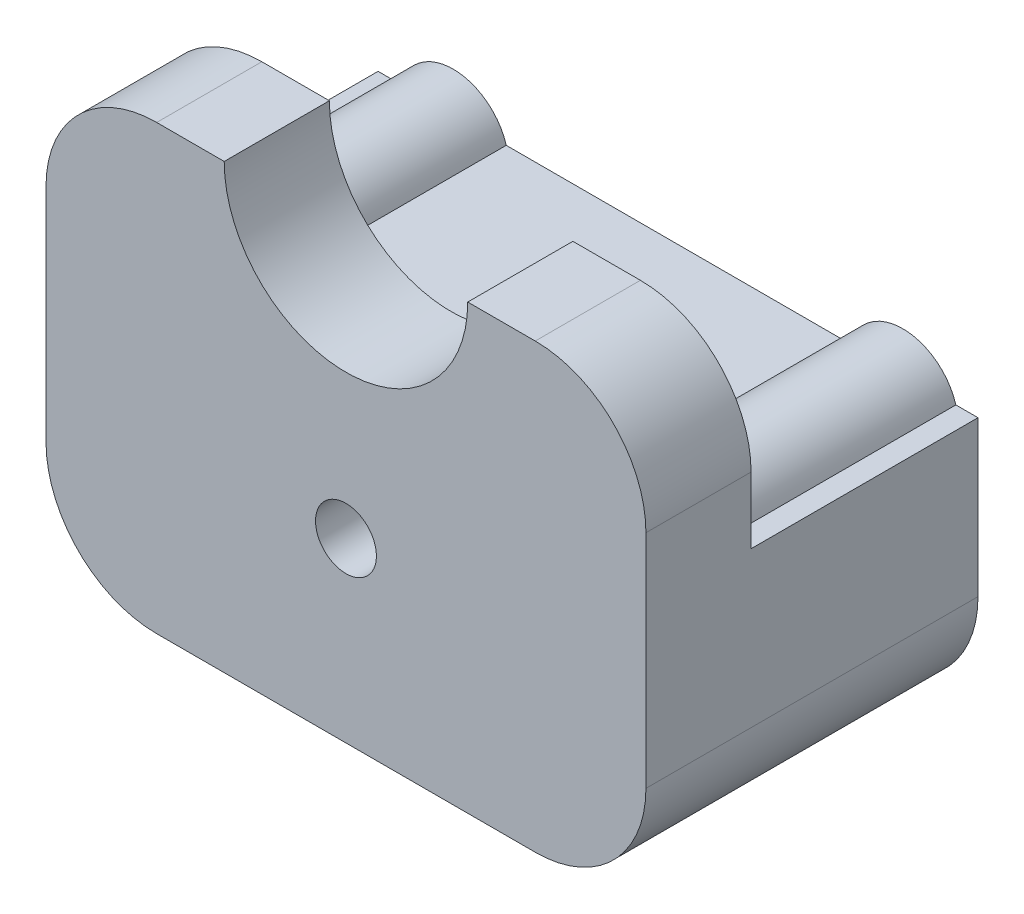
ISO-10303-21;
HEADER;
FILE_DESCRIPTION(('STEP AP214'),'2;1');
FILE_NAME('part.step','',(''),(''),'','','');
FILE_SCHEMA(('AUTOMOTIVE_DESIGN { 1 0 10303 214 1 1 1 1 }'));
ENDSEC;
DATA;
#1=APPLICATION_CONTEXT('core data for automotive mechanical design processes');
#2=APPLICATION_PROTOCOL_DEFINITION('international standard','automotive_design',2000,#1);
#3=PRODUCT_CONTEXT('',#1,'mechanical');
#4=PRODUCT('Part','Part','',(#3));
#5=PRODUCT_RELATED_PRODUCT_CATEGORY('part','',(#4));
#6=PRODUCT_DEFINITION_FORMATION('','',#4);
#7=PRODUCT_DEFINITION_CONTEXT('part definition',#1,'design');
#8=PRODUCT_DEFINITION('design','',#6,#7);
#9=PRODUCT_DEFINITION_SHAPE('','',#8);
#10=(LENGTH_UNIT() NAMED_UNIT(*) SI_UNIT(.MILLI.,.METRE.));
#11=(NAMED_UNIT(*) PLANE_ANGLE_UNIT() SI_UNIT($,.RADIAN.));
#12=(NAMED_UNIT(*) SI_UNIT($,.STERADIAN.) SOLID_ANGLE_UNIT());
#13=UNCERTAINTY_MEASURE_WITH_UNIT(LENGTH_MEASURE(1.E-05),#10,'distance_accuracy_value','');
#14=(GEOMETRIC_REPRESENTATION_CONTEXT(3) GLOBAL_UNCERTAINTY_ASSIGNED_CONTEXT((#13)) GLOBAL_UNIT_ASSIGNED_CONTEXT((#10,
#11,#12)) REPRESENTATION_CONTEXT('',''));
#15=CARTESIAN_POINT('',(0.,0.,0.));
#16=DIRECTION('',(0.,0.,1.));
#17=DIRECTION('',(1.,0.,0.));
#18=AXIS2_PLACEMENT_3D('',#15,#16,#17);
#19=CARTESIAN_POINT('',(0.,40.,25.));
#20=DIRECTION('',(0.,1.,0.));
#21=DIRECTION('',(-1.,0.,0.));
#22=AXIS2_PLACEMENT_3D('',#19,#20,#21);
#23=PLANE('',#22);
#24=DIRECTION('',(0.,0.,-1.));
#25=VECTOR('',#24,1.);
#26=CARTESIAN_POINT('',(-10.,40.,25.));
#27=LINE('',#26,#25);
#28=CARTESIAN_POINT('',(-10.,40.,30.));
#29=VERTEX_POINT('',#28);
#30=CARTESIAN_POINT('',(-10.,40.,20.5));
#31=VERTEX_POINT('',#30);
#32=EDGE_CURVE('E376',#29,#31,#27,.T.);
#33=ORIENTED_EDGE('',*,*,#32,.T.);
#34=DIRECTION('',(1.,0.,0.));
#35=VECTOR('',#34,1.);
#36=CARTESIAN_POINT('',(0.,40.,20.5));
#37=LINE('',#36,#35);
#38=CARTESIAN_POINT('',(-16.1,40.,20.5));
#39=VERTEX_POINT('',#38);
#40=EDGE_CURVE('E235',#39,#31,#37,.T.);
#41=ORIENTED_EDGE('',*,*,#40,.F.);
#42=DIRECTION('',(0.,0.,-1.));
#43=VECTOR('',#42,1.);
#44=CARTESIAN_POINT('',(-16.1,40.,25.));
#45=LINE('',#44,#43);
#46=CARTESIAN_POINT('',(-16.1,40.,30.));
#47=VERTEX_POINT('',#46);
#48=EDGE_CURVE('E339',#47,#39,#45,.T.);
#49=ORIENTED_EDGE('',*,*,#48,.F.);
#50=DIRECTION('',(-1.,0.,0.));
#51=VECTOR('',#50,1.);
#52=CARTESIAN_POINT('',(0.,40.,30.));
#53=LINE('',#52,#51);
#54=EDGE_CURVE('E274',#29,#47,#53,.T.);
#55=ORIENTED_EDGE('',*,*,#54,.F.);
#56=EDGE_LOOP('',(#33,#41,#49,#55));
#57=FACE_BOUND('',#56,.T.);
#58=ADVANCED_FACE('F35',(#57),#23,.T.);
#59=CARTESIAN_POINT('',(-27.1,40.,25.));
#60=DIRECTION('',(0.,0.,-1.));
#61=DIRECTION('',(-1.,0.,0.));
#62=AXIS2_PLACEMENT_3D('',#59,#60,#61);
#63=CYLINDRICAL_SURFACE('',#62,11.);
#64=ORIENTED_EDGE('',*,*,#48,.T.);
#65=CARTESIAN_POINT('',(-27.1,40.,20.5));
#66=DIRECTION('',(0.,0.,-1.));
#67=DIRECTION('',(-1.,0.,0.));
#68=AXIS2_PLACEMENT_3D('',#65,#66,#67);
#69=CIRCLE('',#68,11.);
#70=CARTESIAN_POINT('',(-38.1,40.,20.5));
#71=VERTEX_POINT('',#70);
#72=EDGE_CURVE('E233',#71,#39,#69,.F.);
#73=ORIENTED_EDGE('',*,*,#72,.F.);
#74=DIRECTION('',(0.,0.,-1.));
#75=VECTOR('',#74,1.);
#76=CARTESIAN_POINT('',(-38.1,40.,25.));
#77=LINE('',#76,#75);
#78=CARTESIAN_POINT('',(-38.1,40.,30.));
#79=VERTEX_POINT('',#78);
#80=EDGE_CURVE('E336',#79,#71,#77,.T.);
#81=ORIENTED_EDGE('',*,*,#80,.F.);
#82=CARTESIAN_POINT('',(-27.1,40.,30.));
#83=DIRECTION('',(0.,0.,-1.));
#84=DIRECTION('',(1.,0.,0.));
#85=AXIS2_PLACEMENT_3D('',#82,#83,#84);
#86=CIRCLE('',#85,11.);
#87=EDGE_CURVE('E276',#47,#79,#86,.T.);
#88=ORIENTED_EDGE('',*,*,#87,.F.);
#89=EDGE_LOOP('',(#64,#73,#81,#88));
#90=FACE_BOUND('',#89,.T.);
#91=ADVANCED_FACE('F441',(#90),#63,.F.);
#92=CARTESIAN_POINT('',(0.,40.,25.));
#93=DIRECTION('',(0.,-1.,0.));
#94=DIRECTION('',(1.,0.,0.));
#95=AXIS2_PLACEMENT_3D('',#92,#93,#94);
#96=PLANE('',#95);
#97=DIRECTION('',(1.,0.,0.));
#98=VECTOR('',#97,1.);
#99=CARTESIAN_POINT('',(0.,40.,20.5));
#100=LINE('',#99,#98);
#101=CARTESIAN_POINT('',(-44.2,40.,20.5));
#102=VERTEX_POINT('',#101);
#103=EDGE_CURVE('E231',#102,#71,#100,.T.);
#104=ORIENTED_EDGE('',*,*,#103,.F.);
#105=DIRECTION('',(0.,0.,-1.));
#106=VECTOR('',#105,1.);
#107=CARTESIAN_POINT('',(-44.2,40.,30.));
#108=LINE('',#107,#106);
#109=CARTESIAN_POINT('',(-44.2,40.,30.));
#110=VERTEX_POINT('',#109);
#111=EDGE_CURVE('E43',#102,#110,#108,.F.);
#112=ORIENTED_EDGE('',*,*,#111,.T.);
#113=DIRECTION('',(-1.,0.,0.));
#114=VECTOR('',#113,1.);
#115=CARTESIAN_POINT('',(-54.2,40.,30.));
#116=LINE('',#115,#114);
#117=EDGE_CURVE('E264',#79,#110,#116,.T.);
#118=ORIENTED_EDGE('',*,*,#117,.F.);
#119=ORIENTED_EDGE('',*,*,#80,.T.);
#120=EDGE_LOOP('',(#104,#112,#118,#119));
#121=FACE_BOUND('',#120,.T.);
#122=ADVANCED_FACE('F390',(#121),#96,.F.);
#123=CARTESIAN_POINT('',(-54.2,0.,25.));
#124=DIRECTION('',(-1.,0.,0.));
#125=DIRECTION('',(0.,0.,1.));
#126=AXIS2_PLACEMENT_3D('',#123,#124,#125);
#127=PLANE('',#126);
#128=DIRECTION('',(0.,1.,0.));
#129=VECTOR('',#128,1.);
#130=CARTESIAN_POINT('',(-54.2,0.,20.5));
#131=LINE('',#130,#129);
#132=CARTESIAN_POINT('',(-54.2,24.,20.5));
#133=VERTEX_POINT('',#132);
#134=CARTESIAN_POINT('',(-54.2,30.,20.5));
#135=VERTEX_POINT('',#134);
#136=EDGE_CURVE('E50',#133,#135,#131,.T.);
#137=ORIENTED_EDGE('',*,*,#136,.F.);
#138=DIRECTION('',(0.,0.,-1.));
#139=VECTOR('',#138,1.);
#140=CARTESIAN_POINT('',(-54.2,24.,20.5));
#141=LINE('',#140,#139);
#142=CARTESIAN_POINT('',(-54.2,24.,0.));
#143=VERTEX_POINT('',#142);
#144=EDGE_CURVE('E258',#133,#143,#141,.T.);
#145=ORIENTED_EDGE('',*,*,#144,.T.);
#146=DIRECTION('',(0.,1.,0.));
#147=VECTOR('',#146,1.);
#148=CARTESIAN_POINT('',(-54.2,0.,0.));
#149=LINE('',#148,#147);
#150=CARTESIAN_POINT('',(-54.2,9.99999999999999,0.));
#151=VERTEX_POINT('',#150);
#152=EDGE_CURVE('E331',#151,#143,#149,.T.);
#153=ORIENTED_EDGE('',*,*,#152,.F.);
#154=DIRECTION('',(0.,0.,-1.));
#155=VECTOR('',#154,1.);
#156=CARTESIAN_POINT('',(-54.2,9.99999999999999,25.));
#157=LINE('',#156,#155);
#158=CARTESIAN_POINT('',(-54.2,9.99999999999999,30.));
#159=VERTEX_POINT('',#158);
#160=EDGE_CURVE('E373',#151,#159,#157,.F.);
#161=ORIENTED_EDGE('',*,*,#160,.T.);
#162=DIRECTION('',(0.,-1.,0.));
#163=VECTOR('',#162,1.);
#164=CARTESIAN_POINT('',(-54.2,40.,30.));
#165=LINE('',#164,#163);
#166=CARTESIAN_POINT('',(-54.2,30.,30.));
#167=VERTEX_POINT('',#166);
#168=EDGE_CURVE('E266',#167,#159,#165,.T.);
#169=ORIENTED_EDGE('',*,*,#168,.F.);
#170=DIRECTION('',(0.,0.,-1.));
#171=VECTOR('',#170,1.);
#172=CARTESIAN_POINT('',(-54.2,30.,0.));
#173=LINE('',#172,#171);
#174=EDGE_CURVE('E384',#167,#135,#173,.T.);
#175=ORIENTED_EDGE('',*,*,#174,.T.);
#176=EDGE_LOOP('',(#137,#145,#153,#161,#169,#175));
#177=FACE_BOUND('',#176,.T.);
#178=ADVANCED_FACE('F396',(#177),#127,.T.);
#179=CARTESIAN_POINT('',(0.,0.,0.));
#180=DIRECTION('',(0.,0.,1.));
#181=DIRECTION('',(1.,0.,0.));
#182=AXIS2_PLACEMENT_3D('',#179,#180,#181);
#183=PLANE('',#182);
#184=CARTESIAN_POINT('',(-27.1,16.,0.));
#185=DIRECTION('',(0.,0.,-1.));
#186=DIRECTION('',(-1.,0.,0.));
#187=AXIS2_PLACEMENT_3D('',#184,#185,#186);
#188=CIRCLE('',#187,2.75);
#189=CARTESIAN_POINT('',(-29.85,16.,0.));
#190=VERTEX_POINT('',#189);
#191=EDGE_CURVE('E226',#190,#190,#188,.T.);
#192=ORIENTED_EDGE('',*,*,#191,.F.);
#193=EDGE_LOOP('',(#192));
#194=FACE_BOUND('',#193,.T.);
#195=DIRECTION('',(-0.984807753012209,-0.173648177666928,0.));
#196=VECTOR('',#195,1.);
#197=CARTESIAN_POINT('',(-5.39382093993512,30.5898786349278,0.));
#198=LINE('',#197,#196);
#199=CARTESIAN_POINT('',(-45.5774491813895,23.5044207932009,0.));
#200=VERTEX_POINT('',#199);
#201=CARTESIAN_POINT('',(-49.5166801934383,22.8098280825332,0.));
#202=VERTEX_POINT('',#201);
#203=EDGE_CURVE('E279',#200,#202,#198,.T.);
#204=ORIENTED_EDGE('',*,*,#203,.T.);
#205=DIRECTION('',(0.173648177666927,-0.984807753012209,0.));
#206=VECTOR('',#205,1.);
#207=CARTESIAN_POINT('',(-44.1228592535032,-7.78005055239463,0.));
#208=LINE('',#207,#206);
#209=CARTESIAN_POINT('',(-46.2,3.99999999999999,0.));
#210=VERTEX_POINT('',#209);
#211=EDGE_CURVE('E326',#202,#210,#208,.T.);
#212=ORIENTED_EDGE('',*,*,#211,.T.);
#213=DIRECTION('',(1.,0.,0.));
#214=VECTOR('',#213,1.);
#215=CARTESIAN_POINT('',(0.,3.99999999999999,0.));
#216=LINE('',#215,#214);
#217=CARTESIAN_POINT('',(-8.,3.99999999999999,0.));
#218=VERTEX_POINT('',#217);
#219=EDGE_CURVE('E323',#210,#218,#216,.T.);
#220=ORIENTED_EDGE('',*,*,#219,.T.);
#221=DIRECTION('',(0.173648177666926,0.984807753012209,0.));
#222=VECTOR('',#221,1.);
#223=CARTESIAN_POINT('',(-8.44281076979497,1.48869533173082,0.));
#224=LINE('',#223,#222);
#225=CARTESIAN_POINT('',(-4.68331980656171,22.8098280825332,0.));
#226=VERTEX_POINT('',#225);
#227=EDGE_CURVE('E320',#218,#226,#224,.T.);
#228=ORIENTED_EDGE('',*,*,#227,.T.);
#229=DIRECTION('',(-0.984807753012209,0.173648177666927,0.));
#230=VECTOR('',#229,1.);
#231=CARTESIAN_POINT('',(3.75949096323328,21.3211327508023,0.));
#232=LINE('',#231,#230);
#233=CARTESIAN_POINT('',(-8.62255081861054,23.5044207932009,0.));
#234=VERTEX_POINT('',#233);
#235=EDGE_CURVE('E317',#226,#234,#232,.T.);
#236=ORIENTED_EDGE('',*,*,#235,.T.);
#237=DIRECTION('',(-0.173648177666926,-0.984807753012209,0.));
#238=VECTOR('',#237,1.);
#239=CARTESIAN_POINT('',(-12.3820417818438,2.18328804239852,0.));
#240=LINE('',#239,#238);
#241=CARTESIAN_POINT('',(-11.3563985247091,7.99999999999999,0.));
#242=VERTEX_POINT('',#241);
#243=EDGE_CURVE('E314',#234,#242,#240,.T.);
#244=ORIENTED_EDGE('',*,*,#243,.T.);
#245=DIRECTION('',(-1.,0.,0.));
#246=VECTOR('',#245,1.);
#247=CARTESIAN_POINT('',(0.,7.99999999999999,0.));
#248=LINE('',#247,#246);
#249=CARTESIAN_POINT('',(-42.8436014752909,7.99999999999999,0.));
#250=VERTEX_POINT('',#249);
#251=EDGE_CURVE('E311',#242,#250,#248,.T.);
#252=ORIENTED_EDGE('',*,*,#251,.T.);
#253=DIRECTION('',(-0.173648177666927,0.984807753012209,0.));
#254=VECTOR('',#253,1.);
#255=CARTESIAN_POINT('',(-40.1836282414544,-7.08545784172692,0.));
#256=LINE('',#255,#254);
#257=EDGE_CURVE('E308',#250,#200,#256,.T.);
#258=ORIENTED_EDGE('',*,*,#257,.T.);
#259=EDGE_LOOP('',(#204,#212,#220,#228,#236,#244,#252,#258));
#260=FACE_BOUND('',#259,.T.);
#261=CARTESIAN_POINT('',(-6.79066728181474,22.5683900688561,0.));
#262=DIRECTION('',(0.,0.,-1.));
#263=DIRECTION('',(-1.,0.,0.));
#264=AXIS2_PLACEMENT_3D('',#261,#262,#263);
#265=CIRCLE('',#264,5.);
#266=CARTESIAN_POINT('',(-2.,24.,0.));
#267=VERTEX_POINT('',#266);
#268=CARTESIAN_POINT('',(-11.5813345636295,24.,0.));
#269=VERTEX_POINT('',#268);
#270=EDGE_CURVE('E220',#267,#269,#265,.F.);
#271=ORIENTED_EDGE('',*,*,#270,.F.);
#272=DIRECTION('',(-1.,0.,0.));
#273=VECTOR('',#272,1.);
#274=CARTESIAN_POINT('',(0.,24.,0.));
#275=LINE('',#274,#273);
#276=CARTESIAN_POINT('',(0.,24.,0.));
#277=VERTEX_POINT('',#276);
#278=EDGE_CURVE('E223',#277,#267,#275,.T.);
#279=ORIENTED_EDGE('',*,*,#278,.F.);
#280=DIRECTION('',(0.,-1.,0.));
#281=VECTOR('',#280,1.);
#282=CARTESIAN_POINT('',(0.,0.,0.));
#283=LINE('',#282,#281);
#284=CARTESIAN_POINT('',(0.,10.,0.));
#285=VERTEX_POINT('',#284);
#286=EDGE_CURVE('E329',#277,#285,#283,.T.);
#287=ORIENTED_EDGE('',*,*,#286,.T.);
#288=CARTESIAN_POINT('',(-10.,10.,0.));
#289=DIRECTION('',(0.,0.,1.));
#290=DIRECTION('',(1.,0.,0.));
#291=AXIS2_PLACEMENT_3D('',#288,#289,#290);
#292=CIRCLE('',#291,10.);
#293=CARTESIAN_POINT('',(-10.,0.,0.));
#294=VERTEX_POINT('',#293);
#295=EDGE_CURVE('E362',#285,#294,#292,.F.);
#296=ORIENTED_EDGE('',*,*,#295,.T.);
#297=DIRECTION('',(-1.,0.,0.));
#298=VECTOR('',#297,1.);
#299=CARTESIAN_POINT('',(0.,0.,0.));
#300=LINE('',#299,#298);
#301=CARTESIAN_POINT('',(-44.2,0.,0.));
#302=VERTEX_POINT('',#301);
#303=EDGE_CURVE('E284',#294,#302,#300,.T.);
#304=ORIENTED_EDGE('',*,*,#303,.T.);
#305=CARTESIAN_POINT('',(-44.2,9.99999999999999,0.));
#306=DIRECTION('',(0.,0.,1.));
#307=DIRECTION('',(1.,0.,0.));
#308=AXIS2_PLACEMENT_3D('',#305,#306,#307);
#309=CIRCLE('',#308,10.);
#310=EDGE_CURVE('E360',#302,#151,#309,.F.);
#311=ORIENTED_EDGE('',*,*,#310,.T.);
#312=ORIENTED_EDGE('',*,*,#152,.T.);
#313=DIRECTION('',(1.,0.,0.));
#314=VECTOR('',#313,1.);
#315=CARTESIAN_POINT('',(0.,24.,0.));
#316=LINE('',#315,#314);
#317=CARTESIAN_POINT('',(-52.2,24.,0.));
#318=VERTEX_POINT('',#317);
#319=EDGE_CURVE('E246',#143,#318,#316,.T.);
#320=ORIENTED_EDGE('',*,*,#319,.T.);
#321=CARTESIAN_POINT('',(-47.4093327181853,22.5683900688561,0.));
#322=DIRECTION('',(0.,0.,-1.));
#323=DIRECTION('',(-1.,0.,0.));
#324=AXIS2_PLACEMENT_3D('',#321,#322,#323);
#325=CIRCLE('',#324,5.);
#326=CARTESIAN_POINT('',(-42.6186654363705,24.,0.));
#327=VERTEX_POINT('',#326);
#328=EDGE_CURVE('E243',#327,#318,#325,.F.);
#329=ORIENTED_EDGE('',*,*,#328,.F.);
#330=DIRECTION('',(-1.,0.,0.));
#331=VECTOR('',#330,1.);
#332=CARTESIAN_POINT('',(0.,24.,0.));
#333=LINE('',#332,#331);
#334=EDGE_CURVE('E204',#269,#327,#333,.T.);
#335=ORIENTED_EDGE('',*,*,#334,.F.);
#336=EDGE_LOOP('',(#271,#279,#287,#296,#304,#311,#312,#320,#329,#335));
#337=FACE_BOUND('',#336,.T.);
#338=ADVANCED_FACE('F411',(#194,#260,#337),#183,.F.);
#339=CARTESIAN_POINT('',(-10.,30.,25.));
#340=DIRECTION('',(0.,0.,-1.));
#341=DIRECTION('',(-1.,0.,0.));
#342=AXIS2_PLACEMENT_3D('',#339,#340,#341);
#343=CYLINDRICAL_SURFACE('',#342,10.);
#344=DIRECTION('',(0.,0.,-1.));
#345=VECTOR('',#344,1.);
#346=CARTESIAN_POINT('',(0.,30.,25.));
#347=LINE('',#346,#345);
#348=CARTESIAN_POINT('',(0.,30.,20.5));
#349=VERTEX_POINT('',#348);
#350=CARTESIAN_POINT('',(0.,30.,30.));
#351=VERTEX_POINT('',#350);
#352=EDGE_CURVE('E379',#349,#351,#347,.F.);
#353=ORIENTED_EDGE('',*,*,#352,.F.);
#354=CARTESIAN_POINT('',(-10.,30.,20.5));
#355=DIRECTION('',(0.,0.,-1.));
#356=DIRECTION('',(-1.,0.,0.));
#357=AXIS2_PLACEMENT_3D('',#354,#355,#356);
#358=CIRCLE('',#357,10.);
#359=EDGE_CURVE('E253',#349,#31,#358,.F.);
#360=ORIENTED_EDGE('',*,*,#359,.T.);
#361=ORIENTED_EDGE('',*,*,#32,.F.);
#362=CARTESIAN_POINT('',(-10.,30.,30.));
#363=DIRECTION('',(0.,0.,1.));
#364=DIRECTION('',(1.,0.,0.));
#365=AXIS2_PLACEMENT_3D('',#362,#363,#364);
#366=CIRCLE('',#365,10.);
#367=EDGE_CURVE('E382',#351,#29,#366,.T.);
#368=ORIENTED_EDGE('',*,*,#367,.F.);
#369=EDGE_LOOP('',(#353,#360,#361,#368));
#370=FACE_BOUND('',#369,.T.);
#371=ADVANCED_FACE('F433',(#370),#343,.T.);
#372=CARTESIAN_POINT('',(-44.2,30.,25.));
#373=DIRECTION('',(0.,0.,1.));
#374=DIRECTION('',(1.,0.,0.));
#375=AXIS2_PLACEMENT_3D('',#372,#373,#374);
#376=CYLINDRICAL_SURFACE('',#375,10.);
#377=ORIENTED_EDGE('',*,*,#111,.F.);
#378=CARTESIAN_POINT('',(-44.2,30.,20.5));
#379=DIRECTION('',(0.,0.,-1.));
#380=DIRECTION('',(-1.,0.,0.));
#381=AXIS2_PLACEMENT_3D('',#378,#379,#380);
#382=CIRCLE('',#381,10.);
#383=EDGE_CURVE('E11',#102,#135,#382,.F.);
#384=ORIENTED_EDGE('',*,*,#383,.T.);
#385=ORIENTED_EDGE('',*,*,#174,.F.);
#386=CARTESIAN_POINT('',(-44.2,30.,30.));
#387=DIRECTION('',(0.,0.,1.));
#388=DIRECTION('',(1.,0.,0.));
#389=AXIS2_PLACEMENT_3D('',#386,#387,#388);
#390=CIRCLE('',#389,10.);
#391=EDGE_CURVE('E57',#110,#167,#390,.T.);
#392=ORIENTED_EDGE('',*,*,#391,.F.);
#393=EDGE_LOOP('',(#377,#384,#385,#392));
#394=FACE_BOUND('',#393,.T.);
#395=ADVANCED_FACE('F37',(#394),#376,.T.);
#396=CARTESIAN_POINT('',(0.,0.,25.));
#397=DIRECTION('',(1.,0.,0.));
#398=DIRECTION('',(0.,1.,0.));
#399=AXIS2_PLACEMENT_3D('',#396,#397,#398);
#400=PLANE('',#399);
#401=DIRECTION('',(0.,0.,-1.));
#402=VECTOR('',#401,1.);
#403=CARTESIAN_POINT('',(0.,24.,20.5));
#404=LINE('',#403,#402);
#405=CARTESIAN_POINT('',(0.,24.,20.5));
#406=VERTEX_POINT('',#405);
#407=EDGE_CURVE('E256',#406,#277,#404,.T.);
#408=ORIENTED_EDGE('',*,*,#407,.F.);
#409=DIRECTION('',(0.,-1.,0.));
#410=VECTOR('',#409,1.);
#411=CARTESIAN_POINT('',(0.,0.,20.5));
#412=LINE('',#411,#410);
#413=EDGE_CURVE('E237',#349,#406,#412,.T.);
#414=ORIENTED_EDGE('',*,*,#413,.F.);
#415=ORIENTED_EDGE('',*,*,#352,.T.);
#416=DIRECTION('',(0.,1.,0.));
#417=VECTOR('',#416,1.);
#418=CARTESIAN_POINT('',(0.,0.,30.));
#419=LINE('',#418,#417);
#420=CARTESIAN_POINT('',(0.,10.,30.));
#421=VERTEX_POINT('',#420);
#422=EDGE_CURVE('E271',#421,#351,#419,.T.);
#423=ORIENTED_EDGE('',*,*,#422,.F.);
#424=DIRECTION('',(0.,0.,-1.));
#425=VECTOR('',#424,1.);
#426=CARTESIAN_POINT('',(0.,10.,25.));
#427=LINE('',#426,#425);
#428=EDGE_CURVE('E343',#421,#285,#427,.T.);
#429=ORIENTED_EDGE('',*,*,#428,.T.);
#430=ORIENTED_EDGE('',*,*,#286,.F.);
#431=EDGE_LOOP('',(#408,#414,#415,#423,#429,#430));
#432=FACE_BOUND('',#431,.T.);
#433=ADVANCED_FACE('F424',(#432),#400,.T.);
#434=CARTESIAN_POINT('',(-5.39382093993512,30.5898786349278,25.));
#435=DIRECTION('',(0.173648177666928,-0.984807753012209,0.));
#436=DIRECTION('',(0.984807753012209,0.173648177666928,0.));
#437=AXIS2_PLACEMENT_3D('',#434,#435,#436);
#438=PLANE('',#437);
#439=ORIENTED_EDGE('',*,*,#203,.F.);
#440=DIRECTION('',(0.,0.,-1.));
#441=VECTOR('',#440,1.);
#442=CARTESIAN_POINT('',(-45.5774491813895,23.5044207932009,25.));
#443=LINE('',#442,#441);
#444=CARTESIAN_POINT('',(-45.5774491813895,23.5044207932009,25.));
#445=VERTEX_POINT('',#444);
#446=EDGE_CURVE('E340',#445,#200,#443,.T.);
#447=ORIENTED_EDGE('',*,*,#446,.F.);
#448=DIRECTION('',(-0.984807753012209,-0.173648177666928,0.));
#449=VECTOR('',#448,1.);
#450=CARTESIAN_POINT('',(-5.39382093993512,30.5898786349278,25.));
#451=LINE('',#450,#449);
#452=CARTESIAN_POINT('',(-49.5166801934383,22.8098280825332,25.));
#453=VERTEX_POINT('',#452);
#454=EDGE_CURVE('E280',#445,#453,#451,.T.);
#455=ORIENTED_EDGE('',*,*,#454,.T.);
#456=DIRECTION('',(0.,0.,-1.));
#457=VECTOR('',#456,1.);
#458=CARTESIAN_POINT('',(-49.5166801934383,22.8098280825332,25.));
#459=LINE('',#458,#457);
#460=EDGE_CURVE('E305',#453,#202,#459,.T.);
#461=ORIENTED_EDGE('',*,*,#460,.T.);
#462=EDGE_LOOP('',(#439,#447,#455,#461));
#463=FACE_BOUND('',#462,.T.);
#464=ADVANCED_FACE('F454',(#463),#438,.T.);
#465=CARTESIAN_POINT('',(-40.1836282414544,-7.08545784172692,25.));
#466=DIRECTION('',(-0.984807753012209,-0.173648177666927,0.));
#467=DIRECTION('',(0.173648177666927,-0.984807753012209,0.));
#468=AXIS2_PLACEMENT_3D('',#465,#466,#467);
#469=PLANE('',#468);
#470=ORIENTED_EDGE('',*,*,#257,.F.);
#471=DIRECTION('',(0.,0.,-1.));
#472=VECTOR('',#471,1.);
#473=CARTESIAN_POINT('',(-42.8436014752909,7.99999999999999,25.));
#474=LINE('',#473,#472);
#475=CARTESIAN_POINT('',(-42.8436014752909,7.99999999999999,25.));
#476=VERTEX_POINT('',#475);
#477=EDGE_CURVE('E355',#476,#250,#474,.T.);
#478=ORIENTED_EDGE('',*,*,#477,.F.);
#479=DIRECTION('',(-0.173648177666927,0.984807753012209,0.));
#480=VECTOR('',#479,1.);
#481=CARTESIAN_POINT('',(-40.1836282414544,-7.08545784172692,25.));
#482=LINE('',#481,#480);
#483=EDGE_CURVE('E283',#476,#445,#482,.T.);
#484=ORIENTED_EDGE('',*,*,#483,.T.);
#485=ORIENTED_EDGE('',*,*,#446,.T.);
#486=EDGE_LOOP('',(#470,#478,#484,#485));
#487=FACE_BOUND('',#486,.T.);
#488=ADVANCED_FACE('F478',(#487),#469,.T.);
#489=CARTESIAN_POINT('',(0.,7.99999999999999,25.));
#490=DIRECTION('',(0.,-1.,0.));
#491=DIRECTION('',(1.,0.,0.));
#492=AXIS2_PLACEMENT_3D('',#489,#490,#491);
#493=PLANE('',#492);
#494=ORIENTED_EDGE('',*,*,#251,.F.);
#495=DIRECTION('',(0.,0.,-1.));
#496=VECTOR('',#495,1.);
#497=CARTESIAN_POINT('',(-11.3563985247091,7.99999999999999,25.));
#498=LINE('',#497,#496);
#499=CARTESIAN_POINT('',(-11.3563985247091,7.99999999999999,25.));
#500=VERTEX_POINT('',#499);
#501=EDGE_CURVE('E353',#500,#242,#498,.T.);
#502=ORIENTED_EDGE('',*,*,#501,.F.);
#503=DIRECTION('',(-1.,0.,0.));
#504=VECTOR('',#503,1.);
#505=CARTESIAN_POINT('',(0.,7.99999999999999,25.));
#506=LINE('',#505,#504);
#507=EDGE_CURVE('E287',#500,#476,#506,.T.);
#508=ORIENTED_EDGE('',*,*,#507,.T.);
#509=ORIENTED_EDGE('',*,*,#477,.T.);
#510=EDGE_LOOP('',(#494,#502,#508,#509));
#511=FACE_BOUND('',#510,.T.);
#512=ADVANCED_FACE('F474',(#511),#493,.T.);
#513=CARTESIAN_POINT('',(-12.3820417818438,2.18328804239852,25.));
#514=DIRECTION('',(0.984807753012209,-0.173648177666926,0.));
#515=DIRECTION('',(0.173648177666926,0.984807753012209,0.));
#516=AXIS2_PLACEMENT_3D('',#513,#514,#515);
#517=PLANE('',#516);
#518=ORIENTED_EDGE('',*,*,#243,.F.);
#519=DIRECTION('',(0.,0.,-1.));
#520=VECTOR('',#519,1.);
#521=CARTESIAN_POINT('',(-8.62255081861054,23.5044207932009,25.));
#522=LINE('',#521,#520);
#523=CARTESIAN_POINT('',(-8.62255081861054,23.5044207932009,25.));
#524=VERTEX_POINT('',#523);
#525=EDGE_CURVE('E351',#524,#234,#522,.T.);
#526=ORIENTED_EDGE('',*,*,#525,.F.);
#527=DIRECTION('',(-0.173648177666926,-0.984807753012209,0.));
#528=VECTOR('',#527,1.);
#529=CARTESIAN_POINT('',(-12.3820417818438,2.18328804239852,25.));
#530=LINE('',#529,#528);
#531=EDGE_CURVE('E290',#524,#500,#530,.T.);
#532=ORIENTED_EDGE('',*,*,#531,.T.);
#533=ORIENTED_EDGE('',*,*,#501,.T.);
#534=EDGE_LOOP('',(#518,#526,#532,#533));
#535=FACE_BOUND('',#534,.T.);
#536=ADVANCED_FACE('F470',(#535),#517,.T.);
#537=CARTESIAN_POINT('',(3.75949096323328,21.3211327508023,25.));
#538=DIRECTION('',(-0.173648177666927,-0.984807753012209,0.));
#539=DIRECTION('',(0.984807753012209,-0.173648177666927,0.));
#540=AXIS2_PLACEMENT_3D('',#537,#538,#539);
#541=PLANE('',#540);
#542=ORIENTED_EDGE('',*,*,#235,.F.);
#543=DIRECTION('',(0.,0.,-1.));
#544=VECTOR('',#543,1.);
#545=CARTESIAN_POINT('',(-4.68331980656171,22.8098280825332,25.));
#546=LINE('',#545,#544);
#547=CARTESIAN_POINT('',(-4.68331980656171,22.8098280825332,25.));
#548=VERTEX_POINT('',#547);
#549=EDGE_CURVE('E349',#548,#226,#546,.T.);
#550=ORIENTED_EDGE('',*,*,#549,.F.);
#551=DIRECTION('',(-0.984807753012209,0.173648177666927,0.));
#552=VECTOR('',#551,1.);
#553=CARTESIAN_POINT('',(3.75949096323328,21.3211327508023,25.));
#554=LINE('',#553,#552);
#555=EDGE_CURVE('E293',#548,#524,#554,.T.);
#556=ORIENTED_EDGE('',*,*,#555,.T.);
#557=ORIENTED_EDGE('',*,*,#525,.T.);
#558=EDGE_LOOP('',(#542,#550,#556,#557));
#559=FACE_BOUND('',#558,.T.);
#560=ADVANCED_FACE('F466',(#559),#541,.T.);
#561=CARTESIAN_POINT('',(-8.44281076979497,1.48869533173082,25.));
#562=DIRECTION('',(-0.984807753012209,0.173648177666926,0.));
#563=DIRECTION('',(-0.173648177666926,-0.984807753012209,0.));
#564=AXIS2_PLACEMENT_3D('',#561,#562,#563);
#565=PLANE('',#564);
#566=ORIENTED_EDGE('',*,*,#227,.F.);
#567=DIRECTION('',(0.,0.,-1.));
#568=VECTOR('',#567,1.);
#569=CARTESIAN_POINT('',(-8.,3.99999999999999,25.));
#570=LINE('',#569,#568);
#571=CARTESIAN_POINT('',(-8.,3.99999999999999,25.));
#572=VERTEX_POINT('',#571);
#573=EDGE_CURVE('E347',#572,#218,#570,.T.);
#574=ORIENTED_EDGE('',*,*,#573,.F.);
#575=DIRECTION('',(0.173648177666926,0.984807753012209,0.));
#576=VECTOR('',#575,1.);
#577=CARTESIAN_POINT('',(-8.44281076979497,1.48869533173082,25.));
#578=LINE('',#577,#576);
#579=EDGE_CURVE('E296',#572,#548,#578,.T.);
#580=ORIENTED_EDGE('',*,*,#579,.T.);
#581=ORIENTED_EDGE('',*,*,#549,.T.);
#582=EDGE_LOOP('',(#566,#574,#580,#581));
#583=FACE_BOUND('',#582,.T.);
#584=ADVANCED_FACE('F462',(#583),#565,.T.);
#585=CARTESIAN_POINT('',(0.,3.99999999999999,25.));
#586=DIRECTION('',(0.,1.,0.));
#587=DIRECTION('',(-1.,0.,0.));
#588=AXIS2_PLACEMENT_3D('',#585,#586,#587);
#589=PLANE('',#588);
#590=ORIENTED_EDGE('',*,*,#219,.F.);
#591=DIRECTION('',(0.,0.,-1.));
#592=VECTOR('',#591,1.);
#593=CARTESIAN_POINT('',(-46.2,3.99999999999999,25.));
#594=LINE('',#593,#592);
#595=CARTESIAN_POINT('',(-46.2,3.99999999999999,25.));
#596=VERTEX_POINT('',#595);
#597=EDGE_CURVE('E345',#596,#210,#594,.T.);
#598=ORIENTED_EDGE('',*,*,#597,.F.);
#599=DIRECTION('',(1.,0.,0.));
#600=VECTOR('',#599,1.);
#601=CARTESIAN_POINT('',(0.,3.99999999999999,25.));
#602=LINE('',#601,#600);
#603=EDGE_CURVE('E299',#596,#572,#602,.T.);
#604=ORIENTED_EDGE('',*,*,#603,.T.);
#605=ORIENTED_EDGE('',*,*,#573,.T.);
#606=EDGE_LOOP('',(#590,#598,#604,#605));
#607=FACE_BOUND('',#606,.T.);
#608=ADVANCED_FACE('F458',(#607),#589,.T.);
#609=CARTESIAN_POINT('',(-44.1228592535032,-7.78005055239463,25.));
#610=DIRECTION('',(0.984807753012209,0.173648177666927,0.));
#611=DIRECTION('',(-0.173648177666927,0.984807753012209,0.));
#612=AXIS2_PLACEMENT_3D('',#609,#610,#611);
#613=PLANE('',#612);
#614=ORIENTED_EDGE('',*,*,#211,.F.);
#615=ORIENTED_EDGE('',*,*,#460,.F.);
#616=DIRECTION('',(0.173648177666927,-0.984807753012209,0.));
#617=VECTOR('',#616,1.);
#618=CARTESIAN_POINT('',(-44.1228592535032,-7.78005055239463,25.));
#619=LINE('',#618,#617);
#620=EDGE_CURVE('E302',#453,#596,#619,.T.);
#621=ORIENTED_EDGE('',*,*,#620,.T.);
#622=ORIENTED_EDGE('',*,*,#597,.T.);
#623=EDGE_LOOP('',(#614,#615,#621,#622));
#624=FACE_BOUND('',#623,.T.);
#625=ADVANCED_FACE('F455',(#624),#613,.T.);
#626=CARTESIAN_POINT('',(0.,0.,25.));
#627=DIRECTION('',(0.,-1.,0.));
#628=DIRECTION('',(1.,0.,0.));
#629=AXIS2_PLACEMENT_3D('',#626,#627,#628);
#630=PLANE('',#629);
#631=ORIENTED_EDGE('',*,*,#303,.F.);
#632=DIRECTION('',(0.,0.,-1.));
#633=VECTOR('',#632,1.);
#634=CARTESIAN_POINT('',(-10.,0.,25.));
#635=LINE('',#634,#633);
#636=CARTESIAN_POINT('',(-10.,0.,30.));
#637=VERTEX_POINT('',#636);
#638=EDGE_CURVE('E367',#294,#637,#635,.F.);
#639=ORIENTED_EDGE('',*,*,#638,.T.);
#640=DIRECTION('',(1.,0.,0.));
#641=VECTOR('',#640,1.);
#642=CARTESIAN_POINT('',(-54.2,0.,30.));
#643=LINE('',#642,#641);
#644=CARTESIAN_POINT('',(-44.2,0.,30.));
#645=VERTEX_POINT('',#644);
#646=EDGE_CURVE('E268',#645,#637,#643,.T.);
#647=ORIENTED_EDGE('',*,*,#646,.F.);
#648=DIRECTION('',(0.,0.,-1.));
#649=VECTOR('',#648,1.);
#650=CARTESIAN_POINT('',(-44.2,0.,25.));
#651=LINE('',#650,#649);
#652=EDGE_CURVE('E364',#645,#302,#651,.T.);
#653=ORIENTED_EDGE('',*,*,#652,.T.);
#654=EDGE_LOOP('',(#631,#639,#647,#653));
#655=FACE_BOUND('',#654,.T.);
#656=ADVANCED_FACE('F406',(#655),#630,.T.);
#657=CARTESIAN_POINT('',(-27.1,40.,30.));
#658=DIRECTION('',(0.,0.,1.));
#659=DIRECTION('',(1.,0.,0.));
#660=AXIS2_PLACEMENT_3D('',#657,#658,#659);
#661=PLANE('',#660);
#662=CARTESIAN_POINT('',(-27.1,16.,30.));
#663=DIRECTION('',(0.,0.,-1.));
#664=DIRECTION('',(-1.,0.,0.));
#665=AXIS2_PLACEMENT_3D('',#662,#663,#664);
#666=CIRCLE('',#665,2.75);
#667=CARTESIAN_POINT('',(-29.85,16.,30.));
#668=VERTEX_POINT('',#667);
#669=EDGE_CURVE('E244',#668,#668,#666,.T.);
#670=ORIENTED_EDGE('',*,*,#669,.T.);
#671=EDGE_LOOP('',(#670));
#672=FACE_BOUND('',#671,.T.);
#673=ORIENTED_EDGE('',*,*,#422,.T.);
#674=ORIENTED_EDGE('',*,*,#367,.T.);
#675=ORIENTED_EDGE('',*,*,#54,.T.);
#676=ORIENTED_EDGE('',*,*,#87,.T.);
#677=ORIENTED_EDGE('',*,*,#117,.T.);
#678=ORIENTED_EDGE('',*,*,#391,.T.);
#679=ORIENTED_EDGE('',*,*,#168,.T.);
#680=CARTESIAN_POINT('',(-44.2,9.99999999999999,30.));
#681=DIRECTION('',(0.,0.,1.));
#682=DIRECTION('',(1.,0.,0.));
#683=AXIS2_PLACEMENT_3D('',#680,#681,#682);
#684=CIRCLE('',#683,10.);
#685=EDGE_CURVE('E369',#159,#645,#684,.T.);
#686=ORIENTED_EDGE('',*,*,#685,.T.);
#687=ORIENTED_EDGE('',*,*,#646,.T.);
#688=CARTESIAN_POINT('',(-10.,10.,30.));
#689=DIRECTION('',(0.,0.,1.));
#690=DIRECTION('',(1.,0.,0.));
#691=AXIS2_PLACEMENT_3D('',#688,#689,#690);
#692=CIRCLE('',#691,10.);
#693=EDGE_CURVE('E371',#637,#421,#692,.T.);
#694=ORIENTED_EDGE('',*,*,#693,.T.);
#695=EDGE_LOOP('',(#673,#674,#675,#676,#677,#678,#679,#686,#687,#694));
#696=FACE_BOUND('',#695,.T.);
#697=ADVANCED_FACE('F392',(#672,#696),#661,.T.);
#698=CARTESIAN_POINT('',(-27.1,40.,25.));
#699=DIRECTION('',(0.,0.,1.));
#700=DIRECTION('',(1.,0.,0.));
#701=AXIS2_PLACEMENT_3D('',#698,#699,#700);
#702=PLANE('',#701);
#703=ORIENTED_EDGE('',*,*,#454,.F.);
#704=ORIENTED_EDGE('',*,*,#483,.F.);
#705=ORIENTED_EDGE('',*,*,#507,.F.);
#706=ORIENTED_EDGE('',*,*,#531,.F.);
#707=ORIENTED_EDGE('',*,*,#555,.F.);
#708=ORIENTED_EDGE('',*,*,#579,.F.);
#709=ORIENTED_EDGE('',*,*,#603,.F.);
#710=ORIENTED_EDGE('',*,*,#620,.F.);
#711=EDGE_LOOP('',(#703,#704,#705,#706,#707,#708,#709,#710));
#712=FACE_BOUND('',#711,.T.);
#713=ADVANCED_FACE('F488',(#712),#702,.F.);
#714=CARTESIAN_POINT('',(-10.,10.,25.));
#715=DIRECTION('',(0.,0.,-1.));
#716=DIRECTION('',(-1.,0.,0.));
#717=AXIS2_PLACEMENT_3D('',#714,#715,#716);
#718=CYLINDRICAL_SURFACE('',#717,10.);
#719=ORIENTED_EDGE('',*,*,#693,.F.);
#720=ORIENTED_EDGE('',*,*,#638,.F.);
#721=ORIENTED_EDGE('',*,*,#295,.F.);
#722=ORIENTED_EDGE('',*,*,#428,.F.);
#723=EDGE_LOOP('',(#719,#720,#721,#722));
#724=FACE_BOUND('',#723,.T.);
#725=ADVANCED_FACE('F430',(#724),#718,.T.);
#726=CARTESIAN_POINT('',(-44.2,9.99999999999999,25.));
#727=DIRECTION('',(0.,0.,-1.));
#728=DIRECTION('',(-1.,0.,0.));
#729=AXIS2_PLACEMENT_3D('',#726,#727,#728);
#730=CYLINDRICAL_SURFACE('',#729,10.);
#731=ORIENTED_EDGE('',*,*,#685,.F.);
#732=ORIENTED_EDGE('',*,*,#160,.F.);
#733=ORIENTED_EDGE('',*,*,#310,.F.);
#734=ORIENTED_EDGE('',*,*,#652,.F.);
#735=EDGE_LOOP('',(#731,#732,#733,#734));
#736=FACE_BOUND('',#735,.T.);
#737=ADVANCED_FACE('F408',(#736),#730,.T.);
#738=CARTESIAN_POINT('',(0.,24.,20.5));
#739=DIRECTION('',(0.,-1.,0.));
#740=DIRECTION('',(0.,0.,-1.));
#741=AXIS2_PLACEMENT_3D('',#738,#739,#740);
#742=PLANE('',#741);
#743=ORIENTED_EDGE('',*,*,#334,.T.);
#744=DIRECTION('',(0.,0.,-1.));
#745=VECTOR('',#744,1.);
#746=CARTESIAN_POINT('',(-42.6186654363705,24.,20.5));
#747=LINE('',#746,#745);
#748=CARTESIAN_POINT('',(-42.6186654363705,24.,20.5));
#749=VERTEX_POINT('',#748);
#750=EDGE_CURVE('E197',#749,#327,#747,.T.);
#751=ORIENTED_EDGE('',*,*,#750,.F.);
#752=DIRECTION('',(-1.,0.,0.));
#753=VECTOR('',#752,1.);
#754=CARTESIAN_POINT('',(0.,24.,20.5));
#755=LINE('',#754,#753);
#756=CARTESIAN_POINT('',(-11.5813345636295,24.,20.5));
#757=VERTEX_POINT('',#756);
#758=EDGE_CURVE('E201',#757,#749,#755,.T.);
#759=ORIENTED_EDGE('',*,*,#758,.F.);
#760=DIRECTION('',(0.,0.,-1.));
#761=VECTOR('',#760,1.);
#762=CARTESIAN_POINT('',(-11.5813345636295,24.,20.5));
#763=LINE('',#762,#761);
#764=EDGE_CURVE('E251',#757,#269,#763,.T.);
#765=ORIENTED_EDGE('',*,*,#764,.T.);
#766=EDGE_LOOP('',(#743,#751,#759,#765));
#767=FACE_BOUND('',#766,.T.);
#768=ADVANCED_FACE('F199',(#767),#742,.F.);
#769=CARTESIAN_POINT('',(-6.79066728181474,22.5683900688561,20.5));
#770=DIRECTION('',(0.,0.,-1.));
#771=DIRECTION('',(-1.,0.,0.));
#772=AXIS2_PLACEMENT_3D('',#769,#770,#771);
#773=CYLINDRICAL_SURFACE('',#772,5.);
#774=ORIENTED_EDGE('',*,*,#270,.T.);
#775=ORIENTED_EDGE('',*,*,#764,.F.);
#776=CARTESIAN_POINT('',(-6.79066728181474,22.5683900688561,20.5));
#777=DIRECTION('',(0.,0.,-1.));
#778=DIRECTION('',(-1.,0.,0.));
#779=AXIS2_PLACEMENT_3D('',#776,#777,#778);
#780=CIRCLE('',#779,5.);
#781=CARTESIAN_POINT('',(-2.,24.,20.5));
#782=VERTEX_POINT('',#781);
#783=EDGE_CURVE('E209',#782,#757,#780,.F.);
#784=ORIENTED_EDGE('',*,*,#783,.F.);
#785=DIRECTION('',(0.,0.,-1.));
#786=VECTOR('',#785,1.);
#787=CARTESIAN_POINT('',(-2.,24.,20.5));
#788=LINE('',#787,#786);
#789=EDGE_CURVE('E254',#782,#267,#788,.T.);
#790=ORIENTED_EDGE('',*,*,#789,.T.);
#791=EDGE_LOOP('',(#774,#775,#784,#790));
#792=FACE_BOUND('',#791,.T.);
#793=ADVANCED_FACE('F417',(#792),#773,.T.);
#794=CARTESIAN_POINT('',(0.,24.,20.5));
#795=DIRECTION('',(0.,-1.,0.));
#796=DIRECTION('',(0.,0.,-1.));
#797=AXIS2_PLACEMENT_3D('',#794,#795,#796);
#798=PLANE('',#797);
#799=ORIENTED_EDGE('',*,*,#278,.T.);
#800=ORIENTED_EDGE('',*,*,#789,.F.);
#801=DIRECTION('',(-1.,0.,0.));
#802=VECTOR('',#801,1.);
#803=CARTESIAN_POINT('',(0.,24.,20.5));
#804=LINE('',#803,#802);
#805=EDGE_CURVE('E239',#406,#782,#804,.T.);
#806=ORIENTED_EDGE('',*,*,#805,.F.);
#807=ORIENTED_EDGE('',*,*,#407,.T.);
#808=EDGE_LOOP('',(#799,#800,#806,#807));
#809=FACE_BOUND('',#808,.T.);
#810=ADVANCED_FACE('F420',(#809),#798,.F.);
#811=CARTESIAN_POINT('',(0.,24.,20.5));
#812=DIRECTION('',(0.,1.,0.));
#813=DIRECTION('',(0.,0.,1.));
#814=AXIS2_PLACEMENT_3D('',#811,#812,#813);
#815=PLANE('',#814);
#816=ORIENTED_EDGE('',*,*,#319,.F.);
#817=ORIENTED_EDGE('',*,*,#144,.F.);
#818=DIRECTION('',(1.,0.,0.));
#819=VECTOR('',#818,1.);
#820=CARTESIAN_POINT('',(0.,24.,20.5));
#821=LINE('',#820,#819);
#822=CARTESIAN_POINT('',(-52.2,24.,20.5));
#823=VERTEX_POINT('',#822);
#824=EDGE_CURVE('E215',#133,#823,#821,.T.);
#825=ORIENTED_EDGE('',*,*,#824,.T.);
#826=DIRECTION('',(0.,0.,-1.));
#827=VECTOR('',#826,1.);
#828=CARTESIAN_POINT('',(-52.2,24.,20.5));
#829=LINE('',#828,#827);
#830=EDGE_CURVE('E208',#823,#318,#829,.T.);
#831=ORIENTED_EDGE('',*,*,#830,.T.);
#832=EDGE_LOOP('',(#816,#817,#825,#831));
#833=FACE_BOUND('',#832,.T.);
#834=ADVANCED_FACE('F413',(#833),#815,.T.);
#835=CARTESIAN_POINT('',(-47.4093327181853,22.5683900688561,20.5));
#836=DIRECTION('',(0.,0.,-1.));
#837=DIRECTION('',(-1.,0.,0.));
#838=AXIS2_PLACEMENT_3D('',#835,#836,#837);
#839=CYLINDRICAL_SURFACE('',#838,5.);
#840=ORIENTED_EDGE('',*,*,#328,.T.);
#841=ORIENTED_EDGE('',*,*,#830,.F.);
#842=CARTESIAN_POINT('',(-47.4093327181853,22.5683900688561,20.5));
#843=DIRECTION('',(0.,0.,-1.));
#844=DIRECTION('',(-1.,0.,0.));
#845=AXIS2_PLACEMENT_3D('',#842,#843,#844);
#846=CIRCLE('',#845,5.);
#847=EDGE_CURVE('E213',#749,#823,#846,.F.);
#848=ORIENTED_EDGE('',*,*,#847,.F.);
#849=ORIENTED_EDGE('',*,*,#750,.T.);
#850=EDGE_LOOP('',(#840,#841,#848,#849));
#851=FACE_BOUND('',#850,.T.);
#852=ADVANCED_FACE('F214',(#851),#839,.T.);
#853=CARTESIAN_POINT('',(0.,0.,20.5));
#854=DIRECTION('',(0.,0.,-1.));
#855=DIRECTION('',(-1.,0.,0.));
#856=AXIS2_PLACEMENT_3D('',#853,#854,#855);
#857=PLANE('',#856);
#858=ORIENTED_EDGE('',*,*,#413,.T.);
#859=ORIENTED_EDGE('',*,*,#805,.T.);
#860=ORIENTED_EDGE('',*,*,#783,.T.);
#861=ORIENTED_EDGE('',*,*,#758,.T.);
#862=ORIENTED_EDGE('',*,*,#847,.T.);
#863=ORIENTED_EDGE('',*,*,#824,.F.);
#864=ORIENTED_EDGE('',*,*,#136,.T.);
#865=ORIENTED_EDGE('',*,*,#383,.F.);
#866=ORIENTED_EDGE('',*,*,#103,.T.);
#867=ORIENTED_EDGE('',*,*,#72,.T.);
#868=ORIENTED_EDGE('',*,*,#40,.T.);
#869=ORIENTED_EDGE('',*,*,#359,.F.);
#870=EDGE_LOOP('',(#858,#859,#860,#861,#862,#863,#864,#865,#866,#867,#868,#869));
#871=FACE_BOUND('',#870,.T.);
#872=ADVANCED_FACE('F217',(#871),#857,.T.);
#873=CARTESIAN_POINT('',(-27.1,16.,30.));
#874=DIRECTION('',(0.,0.,-1.));
#875=DIRECTION('',(-1.,0.,0.));
#876=AXIS2_PLACEMENT_3D('',#873,#874,#875);
#877=CYLINDRICAL_SURFACE('',#876,2.75);
#878=ORIENTED_EDGE('',*,*,#669,.F.);
#879=EDGE_LOOP('',(#878));
#880=FACE_BOUND('',#879,.T.);
#881=ORIENTED_EDGE('',*,*,#191,.T.);
#882=EDGE_LOOP('',(#881));
#883=FACE_BOUND('',#882,.T.);
#884=ADVANCED_FACE('F528',(#880,#883),#877,.F.);
#885=CLOSED_SHELL('',(#58,#91,#122,#178,#338,#371,#395,#433,#464,#488,#512,#536,#560,#584,#608,
#625,#656,#697,#713,#725,#737,#768,#793,#810,#834,#852,#872,#884));
#886=MANIFOLD_SOLID_BREP('B2',#885);
#887=ADVANCED_BREP_SHAPE_REPRESENTATION('',(#18,#886),#14);
#888=SHAPE_DEFINITION_REPRESENTATION(#9,#887);
ENDSEC;
END-ISO-10303-21;
